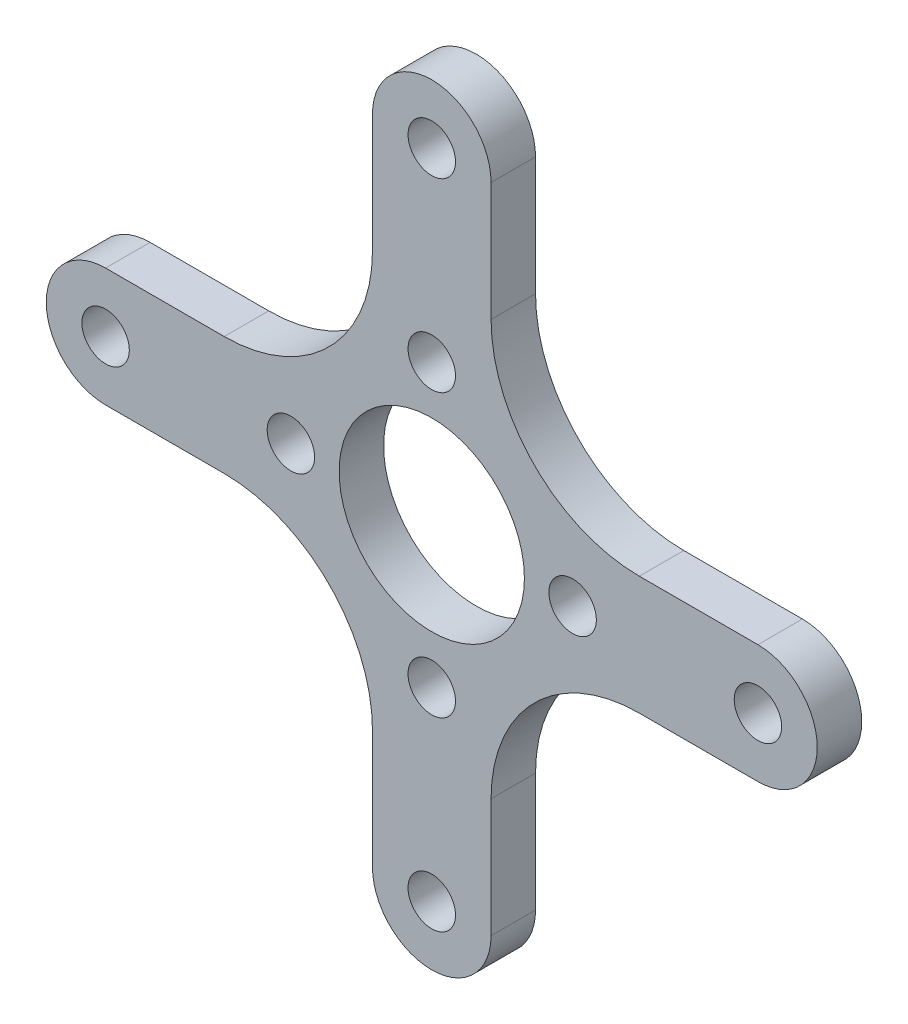
ISO-10303-21;
HEADER;
FILE_DESCRIPTION(('STEP AP214'),'2;1');
FILE_NAME('part.step','',(''),(''),'','','');
FILE_SCHEMA(('AUTOMOTIVE_DESIGN { 1 0 10303 214 1 1 1 1 }'));
ENDSEC;
DATA;
#1=APPLICATION_CONTEXT('core data for automotive mechanical design processes');
#2=APPLICATION_PROTOCOL_DEFINITION('international standard','automotive_design',2000,#1);
#3=PRODUCT_CONTEXT('',#1,'mechanical');
#4=PRODUCT('Part','Part','',(#3));
#5=PRODUCT_RELATED_PRODUCT_CATEGORY('part','',(#4));
#6=PRODUCT_DEFINITION_FORMATION('','',#4);
#7=PRODUCT_DEFINITION_CONTEXT('part definition',#1,'design');
#8=PRODUCT_DEFINITION('design','',#6,#7);
#9=PRODUCT_DEFINITION_SHAPE('','',#8);
#10=(LENGTH_UNIT() NAMED_UNIT(*) SI_UNIT(.MILLI.,.METRE.));
#11=(NAMED_UNIT(*) PLANE_ANGLE_UNIT() SI_UNIT($,.RADIAN.));
#12=(NAMED_UNIT(*) SI_UNIT($,.STERADIAN.) SOLID_ANGLE_UNIT());
#13=UNCERTAINTY_MEASURE_WITH_UNIT(LENGTH_MEASURE(1.E-05),#10,'distance_accuracy_value','');
#14=(GEOMETRIC_REPRESENTATION_CONTEXT(3) GLOBAL_UNCERTAINTY_ASSIGNED_CONTEXT((#13)) GLOBAL_UNIT_ASSIGNED_CONTEXT((#10,
#11,#12)) REPRESENTATION_CONTEXT('',''));
#15=CARTESIAN_POINT('',(0.,0.,0.));
#16=DIRECTION('',(0.,0.,1.));
#17=DIRECTION('',(1.,0.,0.));
#18=AXIS2_PLACEMENT_3D('',#15,#16,#17);
#19=CARTESIAN_POINT('',(-22.,0.,1.5));
#20=DIRECTION('',(0.,0.,-1.));
#21=DIRECTION('',(-1.,0.,0.));
#22=AXIS2_PLACEMENT_3D('',#19,#20,#21);
#23=PLANE('',#22);
#24=CARTESIAN_POINT('',(-22.,0.,1.5));
#25=DIRECTION('',(0.,0.,1.));
#26=DIRECTION('',(-1.,0.,0.));
#27=AXIS2_PLACEMENT_3D('',#24,#25,#26);
#28=CIRCLE('',#27,3.99999999999999);
#29=CARTESIAN_POINT('',(-22.,3.99999999999999,1.5));
#30=VERTEX_POINT('',#29);
#31=CARTESIAN_POINT('',(-22.,-4.,1.5));
#32=VERTEX_POINT('',#31);
#33=EDGE_CURVE('E236',#30,#32,#28,.T.);
#34=ORIENTED_EDGE('',*,*,#33,.T.);
#35=DIRECTION('',(1.,0.,0.));
#36=VECTOR('',#35,1.);
#37=CARTESIAN_POINT('',(-22.,-4.,1.5));
#38=LINE('',#37,#36);
#39=CARTESIAN_POINT('',(-14.,-3.99999999999999,1.5));
#40=VERTEX_POINT('',#39);
#41=EDGE_CURVE('E124',#32,#40,#38,.T.);
#42=ORIENTED_EDGE('',*,*,#41,.T.);
#43=CARTESIAN_POINT('',(-14.,-14.,1.5));
#44=DIRECTION('',(0.,0.,-1.));
#45=DIRECTION('',(-1.,0.,0.));
#46=AXIS2_PLACEMENT_3D('',#43,#44,#45);
#47=CIRCLE('',#46,10.);
#48=CARTESIAN_POINT('',(-3.99999999999999,-14.,1.5));
#49=VERTEX_POINT('',#48);
#50=EDGE_CURVE('E289',#40,#49,#47,.T.);
#51=ORIENTED_EDGE('',*,*,#50,.T.);
#52=DIRECTION('',(0.,-1.,0.));
#53=VECTOR('',#52,1.);
#54=CARTESIAN_POINT('',(-3.99999999999999,-14.,1.5));
#55=LINE('',#54,#53);
#56=CARTESIAN_POINT('',(-3.99999999999999,-22.,1.5));
#57=VERTEX_POINT('',#56);
#58=EDGE_CURVE('E309',#49,#57,#55,.T.);
#59=ORIENTED_EDGE('',*,*,#58,.T.);
#60=CARTESIAN_POINT('',(0.,-22.,1.5));
#61=DIRECTION('',(0.,0.,1.));
#62=DIRECTION('',(-1.,0.,0.));
#63=AXIS2_PLACEMENT_3D('',#60,#61,#62);
#64=CIRCLE('',#63,3.99999999999999);
#65=CARTESIAN_POINT('',(4.,-22.,1.5));
#66=VERTEX_POINT('',#65);
#67=EDGE_CURVE('E305',#57,#66,#64,.T.);
#68=ORIENTED_EDGE('',*,*,#67,.T.);
#69=DIRECTION('',(0.,1.,0.));
#70=VECTOR('',#69,1.);
#71=CARTESIAN_POINT('',(4.00000000000001,-14.,1.5));
#72=LINE('',#71,#70);
#73=CARTESIAN_POINT('',(4.00000000000001,-14.,1.5));
#74=VERTEX_POINT('',#73);
#75=EDGE_CURVE('E308',#66,#74,#72,.T.);
#76=ORIENTED_EDGE('',*,*,#75,.T.);
#77=CARTESIAN_POINT('',(14.,-14.,1.5));
#78=DIRECTION('',(0.,0.,-1.));
#79=DIRECTION('',(1.,0.,0.));
#80=AXIS2_PLACEMENT_3D('',#77,#78,#79);
#81=CIRCLE('',#80,10.);
#82=CARTESIAN_POINT('',(14.,-3.99999999999999,1.5));
#83=VERTEX_POINT('',#82);
#84=EDGE_CURVE('E313',#74,#83,#81,.T.);
#85=ORIENTED_EDGE('',*,*,#84,.T.);
#86=DIRECTION('',(1.,0.,0.));
#87=VECTOR('',#86,1.);
#88=CARTESIAN_POINT('',(22.,-3.99999999999999,1.5));
#89=LINE('',#88,#87);
#90=CARTESIAN_POINT('',(22.,-3.99999999999999,1.5));
#91=VERTEX_POINT('',#90);
#92=EDGE_CURVE('E320',#83,#91,#89,.T.);
#93=ORIENTED_EDGE('',*,*,#92,.T.);
#94=CARTESIAN_POINT('',(22.,0.,1.5));
#95=DIRECTION('',(0.,0.,1.));
#96=DIRECTION('',(1.,0.,0.));
#97=AXIS2_PLACEMENT_3D('',#94,#95,#96);
#98=CIRCLE('',#97,3.99999999999999);
#99=CARTESIAN_POINT('',(22.,3.99999999999999,1.5));
#100=VERTEX_POINT('',#99);
#101=EDGE_CURVE('E323',#91,#100,#98,.T.);
#102=ORIENTED_EDGE('',*,*,#101,.T.);
#103=DIRECTION('',(-1.,0.,0.));
#104=VECTOR('',#103,1.);
#105=CARTESIAN_POINT('',(22.,3.99999999999999,1.5));
#106=LINE('',#105,#104);
#107=CARTESIAN_POINT('',(14.,3.99999999999999,1.5));
#108=VERTEX_POINT('',#107);
#109=EDGE_CURVE('E326',#100,#108,#106,.T.);
#110=ORIENTED_EDGE('',*,*,#109,.T.);
#111=CARTESIAN_POINT('',(14.,14.,1.5));
#112=DIRECTION('',(0.,0.,-1.));
#113=DIRECTION('',(-1.,0.,0.));
#114=AXIS2_PLACEMENT_3D('',#111,#112,#113);
#115=CIRCLE('',#114,10.);
#116=CARTESIAN_POINT('',(4.00000000000001,14.,1.5));
#117=VERTEX_POINT('',#116);
#118=EDGE_CURVE('E329',#108,#117,#115,.T.);
#119=ORIENTED_EDGE('',*,*,#118,.T.);
#120=DIRECTION('',(0.,1.,0.));
#121=VECTOR('',#120,1.);
#122=CARTESIAN_POINT('',(4.00000000000001,14.,1.5));
#123=LINE('',#122,#121);
#124=CARTESIAN_POINT('',(4.,22.,1.5));
#125=VERTEX_POINT('',#124);
#126=EDGE_CURVE('E332',#117,#125,#123,.T.);
#127=ORIENTED_EDGE('',*,*,#126,.T.);
#128=CARTESIAN_POINT('',(0.,22.,1.5));
#129=DIRECTION('',(0.,0.,1.));
#130=DIRECTION('',(1.,0.,0.));
#131=AXIS2_PLACEMENT_3D('',#128,#129,#130);
#132=CIRCLE('',#131,4.);
#133=CARTESIAN_POINT('',(-4.,22.,1.5));
#134=VERTEX_POINT('',#133);
#135=EDGE_CURVE('E167',#125,#134,#132,.T.);
#136=ORIENTED_EDGE('',*,*,#135,.T.);
#137=DIRECTION('',(0.,-1.,0.));
#138=VECTOR('',#137,1.);
#139=CARTESIAN_POINT('',(-3.99999999999999,14.,1.5));
#140=LINE('',#139,#138);
#141=CARTESIAN_POINT('',(-4.,14.,1.5));
#142=VERTEX_POINT('',#141);
#143=EDGE_CURVE('E161',#134,#142,#140,.T.);
#144=ORIENTED_EDGE('',*,*,#143,.T.);
#145=CARTESIAN_POINT('',(-14.,14.,1.5));
#146=DIRECTION('',(0.,0.,-1.));
#147=DIRECTION('',(1.,0.,0.));
#148=AXIS2_PLACEMENT_3D('',#145,#146,#147);
#149=CIRCLE('',#148,10.);
#150=CARTESIAN_POINT('',(-14.,3.99999999999999,1.5));
#151=VERTEX_POINT('',#150);
#152=EDGE_CURVE('E165',#142,#151,#149,.T.);
#153=ORIENTED_EDGE('',*,*,#152,.T.);
#154=DIRECTION('',(-1.,0.,0.));
#155=VECTOR('',#154,1.);
#156=CARTESIAN_POINT('',(-22.,3.99999999999999,1.5));
#157=LINE('',#156,#155);
#158=EDGE_CURVE('E57',#151,#30,#157,.T.);
#159=ORIENTED_EDGE('',*,*,#158,.T.);
#160=EDGE_LOOP('',(#34,#42,#51,#59,#68,#76,#85,#93,#102,#110,#119,#127,#136,#144,#153,#159));
#161=FACE_BOUND('',#160,.T.);
#162=CARTESIAN_POINT('',(0.,0.,1.5));
#163=DIRECTION('',(0.,0.,1.));
#164=DIRECTION('',(1.,0.,0.));
#165=AXIS2_PLACEMENT_3D('',#162,#163,#164);
#166=CIRCLE('',#165,6.25);
#167=CARTESIAN_POINT('',(6.25,0.,1.5));
#168=VERTEX_POINT('',#167);
#169=EDGE_CURVE('E194',#168,#168,#166,.T.);
#170=ORIENTED_EDGE('',*,*,#169,.F.);
#171=EDGE_LOOP('',(#170));
#172=FACE_BOUND('',#171,.T.);
#173=CARTESIAN_POINT('',(-22.,0.,1.5));
#174=DIRECTION('',(0.,0.,1.));
#175=DIRECTION('',(1.,0.,0.));
#176=AXIS2_PLACEMENT_3D('',#173,#174,#175);
#177=CIRCLE('',#176,1.6);
#178=CARTESIAN_POINT('',(-20.4,0.,1.5));
#179=VERTEX_POINT('',#178);
#180=EDGE_CURVE('E462',#179,#179,#177,.T.);
#181=ORIENTED_EDGE('',*,*,#180,.F.);
#182=EDGE_LOOP('',(#181));
#183=FACE_BOUND('',#182,.T.);
#184=CARTESIAN_POINT('',(0.,9.5,1.5));
#185=DIRECTION('',(0.,0.,1.));
#186=DIRECTION('',(1.,0.,0.));
#187=AXIS2_PLACEMENT_3D('',#184,#185,#186);
#188=CIRCLE('',#187,1.6);
#189=CARTESIAN_POINT('',(1.60000000000001,9.5,1.5));
#190=VERTEX_POINT('',#189);
#191=EDGE_CURVE('E454',#190,#190,#188,.T.);
#192=ORIENTED_EDGE('',*,*,#191,.F.);
#193=EDGE_LOOP('',(#192));
#194=FACE_BOUND('',#193,.T.);
#195=CARTESIAN_POINT('',(-9.5,0.,1.5));
#196=DIRECTION('',(0.,0.,1.));
#197=DIRECTION('',(1.,0.,0.));
#198=AXIS2_PLACEMENT_3D('',#195,#196,#197);
#199=CIRCLE('',#198,1.6);
#200=CARTESIAN_POINT('',(-7.9,0.,1.5));
#201=VERTEX_POINT('',#200);
#202=EDGE_CURVE('E446',#201,#201,#199,.T.);
#203=ORIENTED_EDGE('',*,*,#202,.F.);
#204=EDGE_LOOP('',(#203));
#205=FACE_BOUND('',#204,.T.);
#206=CARTESIAN_POINT('',(0.,22.,1.5));
#207=DIRECTION('',(0.,0.,1.));
#208=DIRECTION('',(1.,0.,0.));
#209=AXIS2_PLACEMENT_3D('',#206,#207,#208);
#210=CIRCLE('',#209,1.6);
#211=CARTESIAN_POINT('',(1.60000000000001,22.,1.5));
#212=VERTEX_POINT('',#211);
#213=EDGE_CURVE('E438',#212,#212,#210,.T.);
#214=ORIENTED_EDGE('',*,*,#213,.F.);
#215=EDGE_LOOP('',(#214));
#216=FACE_BOUND('',#215,.T.);
#217=CARTESIAN_POINT('',(22.,0.,1.5));
#218=DIRECTION('',(0.,0.,1.));
#219=DIRECTION('',(-1.,0.,0.));
#220=AXIS2_PLACEMENT_3D('',#217,#218,#219);
#221=CIRCLE('',#220,1.6);
#222=CARTESIAN_POINT('',(20.4,0.,1.5));
#223=VERTEX_POINT('',#222);
#224=EDGE_CURVE('E430',#223,#223,#221,.T.);
#225=ORIENTED_EDGE('',*,*,#224,.F.);
#226=EDGE_LOOP('',(#225));
#227=FACE_BOUND('',#226,.T.);
#228=CARTESIAN_POINT('',(9.5,0.,1.5));
#229=DIRECTION('',(0.,0.,1.));
#230=DIRECTION('',(-1.,0.,0.));
#231=AXIS2_PLACEMENT_3D('',#228,#229,#230);
#232=CIRCLE('',#231,1.6);
#233=CARTESIAN_POINT('',(7.9,0.,1.5));
#234=VERTEX_POINT('',#233);
#235=EDGE_CURVE('E422',#234,#234,#232,.T.);
#236=ORIENTED_EDGE('',*,*,#235,.F.);
#237=EDGE_LOOP('',(#236));
#238=FACE_BOUND('',#237,.T.);
#239=CARTESIAN_POINT('',(0.,-22.,1.5));
#240=DIRECTION('',(0.,0.,1.));
#241=DIRECTION('',(-1.,0.,0.));
#242=AXIS2_PLACEMENT_3D('',#239,#240,#241);
#243=CIRCLE('',#242,1.6);
#244=CARTESIAN_POINT('',(-1.6,-22.,1.5));
#245=VERTEX_POINT('',#244);
#246=EDGE_CURVE('E414',#245,#245,#243,.T.);
#247=ORIENTED_EDGE('',*,*,#246,.F.);
#248=EDGE_LOOP('',(#247));
#249=FACE_BOUND('',#248,.T.);
#250=CARTESIAN_POINT('',(0.,-9.5,1.5));
#251=DIRECTION('',(0.,0.,1.));
#252=DIRECTION('',(-1.,0.,0.));
#253=AXIS2_PLACEMENT_3D('',#250,#251,#252);
#254=CIRCLE('',#253,1.6);
#255=CARTESIAN_POINT('',(-1.59999999999999,-9.5,1.5));
#256=VERTEX_POINT('',#255);
#257=EDGE_CURVE('E403',#256,#256,#254,.T.);
#258=ORIENTED_EDGE('',*,*,#257,.F.);
#259=EDGE_LOOP('',(#258));
#260=FACE_BOUND('',#259,.T.);
#261=ADVANCED_FACE('F39',(#161,#172,#183,#194,#205,#216,#227,#238,#249,#260),#23,.F.);
#262=CARTESIAN_POINT('',(-22.,0.,-1.5));
#263=DIRECTION('',(0.,0.,-1.));
#264=DIRECTION('',(-1.,0.,0.));
#265=AXIS2_PLACEMENT_3D('',#262,#263,#264);
#266=PLANE('',#265);
#267=CARTESIAN_POINT('',(0.,-22.,-1.5));
#268=DIRECTION('',(0.,0.,1.));
#269=DIRECTION('',(-1.,0.,0.));
#270=AXIS2_PLACEMENT_3D('',#267,#268,#269);
#271=CIRCLE('',#270,1.6);
#272=CARTESIAN_POINT('',(-1.6,-22.,-1.5));
#273=VERTEX_POINT('',#272);
#274=EDGE_CURVE('E411',#273,#273,#271,.T.);
#275=ORIENTED_EDGE('',*,*,#274,.T.);
#276=EDGE_LOOP('',(#275));
#277=FACE_BOUND('',#276,.T.);
#278=CARTESIAN_POINT('',(22.,0.,-1.5));
#279=DIRECTION('',(0.,0.,1.));
#280=DIRECTION('',(-1.,0.,0.));
#281=AXIS2_PLACEMENT_3D('',#278,#279,#280);
#282=CIRCLE('',#281,1.6);
#283=CARTESIAN_POINT('',(20.4,0.,-1.5));
#284=VERTEX_POINT('',#283);
#285=EDGE_CURVE('E426',#284,#284,#282,.T.);
#286=ORIENTED_EDGE('',*,*,#285,.T.);
#287=EDGE_LOOP('',(#286));
#288=FACE_BOUND('',#287,.T.);
#289=CARTESIAN_POINT('',(-9.5,0.,-1.5));
#290=DIRECTION('',(0.,0.,1.));
#291=DIRECTION('',(1.,0.,0.));
#292=AXIS2_PLACEMENT_3D('',#289,#290,#291);
#293=CIRCLE('',#292,1.6);
#294=CARTESIAN_POINT('',(-7.9,0.,-1.5));
#295=VERTEX_POINT('',#294);
#296=EDGE_CURVE('E442',#295,#295,#293,.T.);
#297=ORIENTED_EDGE('',*,*,#296,.T.);
#298=EDGE_LOOP('',(#297));
#299=FACE_BOUND('',#298,.T.);
#300=CARTESIAN_POINT('',(-22.,0.,-1.5));
#301=DIRECTION('',(0.,0.,1.));
#302=DIRECTION('',(1.,0.,0.));
#303=AXIS2_PLACEMENT_3D('',#300,#301,#302);
#304=CIRCLE('',#303,1.6);
#305=CARTESIAN_POINT('',(-20.4,0.,-1.5));
#306=VERTEX_POINT('',#305);
#307=EDGE_CURVE('E458',#306,#306,#304,.T.);
#308=ORIENTED_EDGE('',*,*,#307,.T.);
#309=EDGE_LOOP('',(#308));
#310=FACE_BOUND('',#309,.T.);
#311=CARTESIAN_POINT('',(-22.,0.,-1.5));
#312=DIRECTION('',(0.,0.,1.));
#313=DIRECTION('',(-1.,0.,0.));
#314=AXIS2_PLACEMENT_3D('',#311,#312,#313);
#315=CIRCLE('',#314,3.99999999999999);
#316=CARTESIAN_POINT('',(-22.,3.99999999999999,-1.5));
#317=VERTEX_POINT('',#316);
#318=CARTESIAN_POINT('',(-22.,-4.,-1.5));
#319=VERTEX_POINT('',#318);
#320=EDGE_CURVE('E189',#317,#319,#315,.T.);
#321=ORIENTED_EDGE('',*,*,#320,.F.);
#322=DIRECTION('',(-1.,0.,0.));
#323=VECTOR('',#322,1.);
#324=CARTESIAN_POINT('',(-22.,3.99999999999999,-1.5));
#325=LINE('',#324,#323);
#326=CARTESIAN_POINT('',(-14.,3.99999999999999,-1.5));
#327=VERTEX_POINT('',#326);
#328=EDGE_CURVE('E116',#327,#317,#325,.T.);
#329=ORIENTED_EDGE('',*,*,#328,.F.);
#330=CARTESIAN_POINT('',(-14.,14.,-1.5));
#331=DIRECTION('',(0.,0.,-1.));
#332=DIRECTION('',(1.,0.,0.));
#333=AXIS2_PLACEMENT_3D('',#330,#331,#332);
#334=CIRCLE('',#333,10.);
#335=CARTESIAN_POINT('',(-4.,14.,-1.5));
#336=VERTEX_POINT('',#335);
#337=EDGE_CURVE('E110',#336,#327,#334,.T.);
#338=ORIENTED_EDGE('',*,*,#337,.F.);
#339=DIRECTION('',(0.,-1.,0.));
#340=VECTOR('',#339,1.);
#341=CARTESIAN_POINT('',(-3.99999999999999,14.,-1.5));
#342=LINE('',#341,#340);
#343=CARTESIAN_POINT('',(-4.,22.,-1.5));
#344=VERTEX_POINT('',#343);
#345=EDGE_CURVE('E176',#344,#336,#342,.T.);
#346=ORIENTED_EDGE('',*,*,#345,.F.);
#347=CARTESIAN_POINT('',(0.,22.,-1.5));
#348=DIRECTION('',(0.,0.,1.));
#349=DIRECTION('',(1.,0.,0.));
#350=AXIS2_PLACEMENT_3D('',#347,#348,#349);
#351=CIRCLE('',#350,4.);
#352=CARTESIAN_POINT('',(4.,22.,-1.5));
#353=VERTEX_POINT('',#352);
#354=EDGE_CURVE('E227',#353,#344,#351,.T.);
#355=ORIENTED_EDGE('',*,*,#354,.F.);
#356=DIRECTION('',(0.,1.,0.));
#357=VECTOR('',#356,1.);
#358=CARTESIAN_POINT('',(4.00000000000001,14.,-1.5));
#359=LINE('',#358,#357);
#360=CARTESIAN_POINT('',(4.00000000000001,14.,-1.5));
#361=VERTEX_POINT('',#360);
#362=EDGE_CURVE('E224',#361,#353,#359,.T.);
#363=ORIENTED_EDGE('',*,*,#362,.F.);
#364=CARTESIAN_POINT('',(14.,14.,-1.5));
#365=DIRECTION('',(0.,0.,-1.));
#366=DIRECTION('',(-1.,0.,0.));
#367=AXIS2_PLACEMENT_3D('',#364,#365,#366);
#368=CIRCLE('',#367,10.);
#369=CARTESIAN_POINT('',(14.,3.99999999999999,-1.5));
#370=VERTEX_POINT('',#369);
#371=EDGE_CURVE('E221',#370,#361,#368,.T.);
#372=ORIENTED_EDGE('',*,*,#371,.F.);
#373=DIRECTION('',(-1.,0.,0.));
#374=VECTOR('',#373,1.);
#375=CARTESIAN_POINT('',(22.,3.99999999999999,-1.5));
#376=LINE('',#375,#374);
#377=CARTESIAN_POINT('',(22.,3.99999999999999,-1.5));
#378=VERTEX_POINT('',#377);
#379=EDGE_CURVE('E218',#378,#370,#376,.T.);
#380=ORIENTED_EDGE('',*,*,#379,.F.);
#381=CARTESIAN_POINT('',(22.,0.,-1.5));
#382=DIRECTION('',(0.,0.,1.));
#383=DIRECTION('',(1.,0.,0.));
#384=AXIS2_PLACEMENT_3D('',#381,#382,#383);
#385=CIRCLE('',#384,3.99999999999999);
#386=CARTESIAN_POINT('',(22.,-3.99999999999999,-1.5));
#387=VERTEX_POINT('',#386);
#388=EDGE_CURVE('E215',#387,#378,#385,.T.);
#389=ORIENTED_EDGE('',*,*,#388,.F.);
#390=DIRECTION('',(1.,0.,0.));
#391=VECTOR('',#390,1.);
#392=CARTESIAN_POINT('',(22.,-3.99999999999999,-1.5));
#393=LINE('',#392,#391);
#394=CARTESIAN_POINT('',(14.,-3.99999999999999,-1.5));
#395=VERTEX_POINT('',#394);
#396=EDGE_CURVE('E212',#395,#387,#393,.T.);
#397=ORIENTED_EDGE('',*,*,#396,.F.);
#398=CARTESIAN_POINT('',(14.,-14.,-1.5));
#399=DIRECTION('',(0.,0.,-1.));
#400=DIRECTION('',(1.,0.,0.));
#401=AXIS2_PLACEMENT_3D('',#398,#399,#400);
#402=CIRCLE('',#401,10.);
#403=CARTESIAN_POINT('',(4.00000000000001,-14.,-1.5));
#404=VERTEX_POINT('',#403);
#405=EDGE_CURVE('E209',#404,#395,#402,.T.);
#406=ORIENTED_EDGE('',*,*,#405,.F.);
#407=DIRECTION('',(0.,1.,0.));
#408=VECTOR('',#407,1.);
#409=CARTESIAN_POINT('',(4.00000000000001,-14.,-1.5));
#410=LINE('',#409,#408);
#411=CARTESIAN_POINT('',(4.,-22.,-1.5));
#412=VERTEX_POINT('',#411);
#413=EDGE_CURVE('E206',#412,#404,#410,.T.);
#414=ORIENTED_EDGE('',*,*,#413,.F.);
#415=CARTESIAN_POINT('',(0.,-22.,-1.5));
#416=DIRECTION('',(0.,0.,1.));
#417=DIRECTION('',(-1.,0.,0.));
#418=AXIS2_PLACEMENT_3D('',#415,#416,#417);
#419=CIRCLE('',#418,3.99999999999999);
#420=CARTESIAN_POINT('',(-3.99999999999999,-22.,-1.5));
#421=VERTEX_POINT('',#420);
#422=EDGE_CURVE('E203',#421,#412,#419,.T.);
#423=ORIENTED_EDGE('',*,*,#422,.F.);
#424=DIRECTION('',(0.,-1.,0.));
#425=VECTOR('',#424,1.);
#426=CARTESIAN_POINT('',(-3.99999999999999,-14.,-1.5));
#427=LINE('',#426,#425);
#428=CARTESIAN_POINT('',(-3.99999999999999,-14.,-1.5));
#429=VERTEX_POINT('',#428);
#430=EDGE_CURVE('E200',#429,#421,#427,.T.);
#431=ORIENTED_EDGE('',*,*,#430,.F.);
#432=CARTESIAN_POINT('',(-14.,-14.,-1.5));
#433=DIRECTION('',(0.,0.,-1.));
#434=DIRECTION('',(-1.,0.,0.));
#435=AXIS2_PLACEMENT_3D('',#432,#433,#434);
#436=CIRCLE('',#435,10.);
#437=CARTESIAN_POINT('',(-14.,-3.99999999999999,-1.5));
#438=VERTEX_POINT('',#437);
#439=EDGE_CURVE('E197',#438,#429,#436,.T.);
#440=ORIENTED_EDGE('',*,*,#439,.F.);
#441=DIRECTION('',(1.,0.,0.));
#442=VECTOR('',#441,1.);
#443=CARTESIAN_POINT('',(-22.,-4.,-1.5));
#444=LINE('',#443,#442);
#445=EDGE_CURVE('E193',#319,#438,#444,.T.);
#446=ORIENTED_EDGE('',*,*,#445,.F.);
#447=EDGE_LOOP('',(#321,#329,#338,#346,#355,#363,#372,#380,#389,#397,#406,#414,#423,#431,#440,#446));
#448=FACE_BOUND('',#447,.T.);
#449=CARTESIAN_POINT('',(0.,0.,-1.5));
#450=DIRECTION('',(0.,0.,1.));
#451=DIRECTION('',(1.,0.,0.));
#452=AXIS2_PLACEMENT_3D('',#449,#450,#451);
#453=CIRCLE('',#452,6.25);
#454=CARTESIAN_POINT('',(6.25,0.,-1.5));
#455=VERTEX_POINT('',#454);
#456=EDGE_CURVE('E466',#455,#455,#453,.T.);
#457=ORIENTED_EDGE('',*,*,#456,.T.);
#458=EDGE_LOOP('',(#457));
#459=FACE_BOUND('',#458,.T.);
#460=CARTESIAN_POINT('',(0.,9.5,-1.5));
#461=DIRECTION('',(0.,0.,1.));
#462=DIRECTION('',(1.,0.,0.));
#463=AXIS2_PLACEMENT_3D('',#460,#461,#462);
#464=CIRCLE('',#463,1.6);
#465=CARTESIAN_POINT('',(1.60000000000001,9.5,-1.5));
#466=VERTEX_POINT('',#465);
#467=EDGE_CURVE('E450',#466,#466,#464,.T.);
#468=ORIENTED_EDGE('',*,*,#467,.T.);
#469=EDGE_LOOP('',(#468));
#470=FACE_BOUND('',#469,.T.);
#471=CARTESIAN_POINT('',(0.,22.,-1.5));
#472=DIRECTION('',(0.,0.,1.));
#473=DIRECTION('',(1.,0.,0.));
#474=AXIS2_PLACEMENT_3D('',#471,#472,#473);
#475=CIRCLE('',#474,1.6);
#476=CARTESIAN_POINT('',(1.60000000000001,22.,-1.5));
#477=VERTEX_POINT('',#476);
#478=EDGE_CURVE('E434',#477,#477,#475,.T.);
#479=ORIENTED_EDGE('',*,*,#478,.T.);
#480=EDGE_LOOP('',(#479));
#481=FACE_BOUND('',#480,.T.);
#482=CARTESIAN_POINT('',(9.5,0.,-1.5));
#483=DIRECTION('',(0.,0.,1.));
#484=DIRECTION('',(-1.,0.,0.));
#485=AXIS2_PLACEMENT_3D('',#482,#483,#484);
#486=CIRCLE('',#485,1.6);
#487=CARTESIAN_POINT('',(7.9,0.,-1.5));
#488=VERTEX_POINT('',#487);
#489=EDGE_CURVE('E418',#488,#488,#486,.T.);
#490=ORIENTED_EDGE('',*,*,#489,.T.);
#491=EDGE_LOOP('',(#490));
#492=FACE_BOUND('',#491,.T.);
#493=CARTESIAN_POINT('',(0.,-9.5,-1.5));
#494=DIRECTION('',(0.,0.,1.));
#495=DIRECTION('',(-1.,0.,0.));
#496=AXIS2_PLACEMENT_3D('',#493,#494,#495);
#497=CIRCLE('',#496,1.6);
#498=CARTESIAN_POINT('',(-1.59999999999999,-9.5,-1.5));
#499=VERTEX_POINT('',#498);
#500=EDGE_CURVE('E406',#499,#499,#497,.T.);
#501=ORIENTED_EDGE('',*,*,#500,.T.);
#502=EDGE_LOOP('',(#501));
#503=FACE_BOUND('',#502,.T.);
#504=ADVANCED_FACE('F293',(#277,#288,#299,#310,#448,#459,#470,#481,#492,#503),#266,.T.);
#505=CARTESIAN_POINT('',(-22.,0.,1.5));
#506=DIRECTION('',(0.,0.,-1.));
#507=DIRECTION('',(-1.,0.,0.));
#508=AXIS2_PLACEMENT_3D('',#505,#506,#507);
#509=CYLINDRICAL_SURFACE('',#508,3.99999999999999);
#510=ORIENTED_EDGE('',*,*,#320,.T.);
#511=DIRECTION('',(0.,0.,-1.));
#512=VECTOR('',#511,1.);
#513=CARTESIAN_POINT('',(-22.,-4.,1.5));
#514=LINE('',#513,#512);
#515=EDGE_CURVE('E11',#32,#319,#514,.T.);
#516=ORIENTED_EDGE('',*,*,#515,.F.);
#517=ORIENTED_EDGE('',*,*,#33,.F.);
#518=DIRECTION('',(0.,0.,-1.));
#519=VECTOR('',#518,1.);
#520=CARTESIAN_POINT('',(-22.,3.99999999999999,1.5));
#521=LINE('',#520,#519);
#522=EDGE_CURVE('E185',#30,#317,#521,.T.);
#523=ORIENTED_EDGE('',*,*,#522,.T.);
#524=EDGE_LOOP('',(#510,#516,#517,#523));
#525=FACE_BOUND('',#524,.T.);
#526=ADVANCED_FACE('F41',(#525),#509,.T.);
#527=CARTESIAN_POINT('',(-22.,-4.,1.5));
#528=DIRECTION('',(0.,1.,0.));
#529=DIRECTION('',(-1.,0.,0.));
#530=AXIS2_PLACEMENT_3D('',#527,#528,#529);
#531=PLANE('',#530);
#532=ORIENTED_EDGE('',*,*,#445,.T.);
#533=DIRECTION('',(0.,0.,-1.));
#534=VECTOR('',#533,1.);
#535=CARTESIAN_POINT('',(-14.,-3.99999999999999,1.5));
#536=LINE('',#535,#534);
#537=EDGE_CURVE('E49',#40,#438,#536,.T.);
#538=ORIENTED_EDGE('',*,*,#537,.F.);
#539=ORIENTED_EDGE('',*,*,#41,.F.);
#540=ORIENTED_EDGE('',*,*,#515,.T.);
#541=EDGE_LOOP('',(#532,#538,#539,#540));
#542=FACE_BOUND('',#541,.T.);
#543=ADVANCED_FACE('F669',(#542),#531,.F.);
#544=CARTESIAN_POINT('',(-14.,-14.,1.5));
#545=DIRECTION('',(0.,0.,-1.));
#546=DIRECTION('',(-1.,0.,0.));
#547=AXIS2_PLACEMENT_3D('',#544,#545,#546);
#548=CYLINDRICAL_SURFACE('',#547,10.);
#549=ORIENTED_EDGE('',*,*,#439,.T.);
#550=DIRECTION('',(0.,0.,-1.));
#551=VECTOR('',#550,1.);
#552=CARTESIAN_POINT('',(-3.99999999999999,-14.,1.5));
#553=LINE('',#552,#551);
#554=EDGE_CURVE('E279',#49,#429,#553,.T.);
#555=ORIENTED_EDGE('',*,*,#554,.F.);
#556=ORIENTED_EDGE('',*,*,#50,.F.);
#557=ORIENTED_EDGE('',*,*,#537,.T.);
#558=EDGE_LOOP('',(#549,#555,#556,#557));
#559=FACE_BOUND('',#558,.T.);
#560=ADVANCED_FACE('F287',(#559),#548,.F.);
#561=CARTESIAN_POINT('',(-3.99999999999999,-14.,1.5));
#562=DIRECTION('',(1.,0.,0.));
#563=DIRECTION('',(0.,1.,0.));
#564=AXIS2_PLACEMENT_3D('',#561,#562,#563);
#565=PLANE('',#564);
#566=ORIENTED_EDGE('',*,*,#430,.T.);
#567=DIRECTION('',(0.,0.,-1.));
#568=VECTOR('',#567,1.);
#569=CARTESIAN_POINT('',(-3.99999999999999,-22.,1.5));
#570=LINE('',#569,#568);
#571=EDGE_CURVE('E275',#57,#421,#570,.T.);
#572=ORIENTED_EDGE('',*,*,#571,.F.);
#573=ORIENTED_EDGE('',*,*,#58,.F.);
#574=ORIENTED_EDGE('',*,*,#554,.T.);
#575=EDGE_LOOP('',(#566,#572,#573,#574));
#576=FACE_BOUND('',#575,.T.);
#577=ADVANCED_FACE('F299',(#576),#565,.F.);
#578=CARTESIAN_POINT('',(0.,-22.,1.5));
#579=DIRECTION('',(0.,0.,-1.));
#580=DIRECTION('',(-1.,0.,0.));
#581=AXIS2_PLACEMENT_3D('',#578,#579,#580);
#582=CYLINDRICAL_SURFACE('',#581,3.99999999999999);
#583=ORIENTED_EDGE('',*,*,#422,.T.);
#584=DIRECTION('',(0.,0.,-1.));
#585=VECTOR('',#584,1.);
#586=CARTESIAN_POINT('',(4.,-22.,1.5));
#587=LINE('',#586,#585);
#588=EDGE_CURVE('E271',#66,#412,#587,.T.);
#589=ORIENTED_EDGE('',*,*,#588,.F.);
#590=ORIENTED_EDGE('',*,*,#67,.F.);
#591=ORIENTED_EDGE('',*,*,#571,.T.);
#592=EDGE_LOOP('',(#583,#589,#590,#591));
#593=FACE_BOUND('',#592,.T.);
#594=ADVANCED_FACE('F303',(#593),#582,.T.);
#595=CARTESIAN_POINT('',(4.00000000000001,-14.,1.5));
#596=DIRECTION('',(-1.,0.,0.));
#597=DIRECTION('',(0.,-1.,0.));
#598=AXIS2_PLACEMENT_3D('',#595,#596,#597);
#599=PLANE('',#598);
#600=ORIENTED_EDGE('',*,*,#413,.T.);
#601=DIRECTION('',(0.,0.,-1.));
#602=VECTOR('',#601,1.);
#603=CARTESIAN_POINT('',(4.00000000000001,-14.,1.5));
#604=LINE('',#603,#602);
#605=EDGE_CURVE('E267',#74,#404,#604,.T.);
#606=ORIENTED_EDGE('',*,*,#605,.F.);
#607=ORIENTED_EDGE('',*,*,#75,.F.);
#608=ORIENTED_EDGE('',*,*,#588,.T.);
#609=EDGE_LOOP('',(#600,#606,#607,#608));
#610=FACE_BOUND('',#609,.T.);
#611=ADVANCED_FACE('F634',(#610),#599,.F.);
#612=CARTESIAN_POINT('',(14.,-14.,1.5));
#613=DIRECTION('',(0.,0.,-1.));
#614=DIRECTION('',(-1.,0.,0.));
#615=AXIS2_PLACEMENT_3D('',#612,#613,#614);
#616=CYLINDRICAL_SURFACE('',#615,10.);
#617=ORIENTED_EDGE('',*,*,#405,.T.);
#618=DIRECTION('',(0.,0.,-1.));
#619=VECTOR('',#618,1.);
#620=CARTESIAN_POINT('',(14.,-3.99999999999999,1.5));
#621=LINE('',#620,#619);
#622=EDGE_CURVE('E263',#83,#395,#621,.T.);
#623=ORIENTED_EDGE('',*,*,#622,.F.);
#624=ORIENTED_EDGE('',*,*,#84,.F.);
#625=ORIENTED_EDGE('',*,*,#605,.T.);
#626=EDGE_LOOP('',(#617,#623,#624,#625));
#627=FACE_BOUND('',#626,.T.);
#628=ADVANCED_FACE('F624',(#627),#616,.F.);
#629=CARTESIAN_POINT('',(22.,-3.99999999999999,1.5));
#630=DIRECTION('',(0.,1.,0.));
#631=DIRECTION('',(-1.,0.,0.));
#632=AXIS2_PLACEMENT_3D('',#629,#630,#631);
#633=PLANE('',#632);
#634=ORIENTED_EDGE('',*,*,#396,.T.);
#635=DIRECTION('',(0.,0.,-1.));
#636=VECTOR('',#635,1.);
#637=CARTESIAN_POINT('',(22.,-3.99999999999999,1.5));
#638=LINE('',#637,#636);
#639=EDGE_CURVE('E259',#91,#387,#638,.T.);
#640=ORIENTED_EDGE('',*,*,#639,.F.);
#641=ORIENTED_EDGE('',*,*,#92,.F.);
#642=ORIENTED_EDGE('',*,*,#622,.T.);
#643=EDGE_LOOP('',(#634,#640,#641,#642));
#644=FACE_BOUND('',#643,.T.);
#645=ADVANCED_FACE('F614',(#644),#633,.F.);
#646=CARTESIAN_POINT('',(22.,0.,1.5));
#647=DIRECTION('',(0.,0.,-1.));
#648=DIRECTION('',(-1.,0.,0.));
#649=AXIS2_PLACEMENT_3D('',#646,#647,#648);
#650=CYLINDRICAL_SURFACE('',#649,3.99999999999999);
#651=ORIENTED_EDGE('',*,*,#388,.T.);
#652=DIRECTION('',(0.,0.,-1.));
#653=VECTOR('',#652,1.);
#654=CARTESIAN_POINT('',(22.,3.99999999999999,1.5));
#655=LINE('',#654,#653);
#656=EDGE_CURVE('E255',#100,#378,#655,.T.);
#657=ORIENTED_EDGE('',*,*,#656,.F.);
#658=ORIENTED_EDGE('',*,*,#101,.F.);
#659=ORIENTED_EDGE('',*,*,#639,.T.);
#660=EDGE_LOOP('',(#651,#657,#658,#659));
#661=FACE_BOUND('',#660,.T.);
#662=ADVANCED_FACE('F604',(#661),#650,.T.);
#663=CARTESIAN_POINT('',(22.,3.99999999999999,1.5));
#664=DIRECTION('',(0.,-1.,0.));
#665=DIRECTION('',(1.,0.,0.));
#666=AXIS2_PLACEMENT_3D('',#663,#664,#665);
#667=PLANE('',#666);
#668=ORIENTED_EDGE('',*,*,#379,.T.);
#669=DIRECTION('',(0.,0.,-1.));
#670=VECTOR('',#669,1.);
#671=CARTESIAN_POINT('',(14.,3.99999999999999,1.5));
#672=LINE('',#671,#670);
#673=EDGE_CURVE('E251',#108,#370,#672,.T.);
#674=ORIENTED_EDGE('',*,*,#673,.F.);
#675=ORIENTED_EDGE('',*,*,#109,.F.);
#676=ORIENTED_EDGE('',*,*,#656,.T.);
#677=EDGE_LOOP('',(#668,#674,#675,#676));
#678=FACE_BOUND('',#677,.T.);
#679=ADVANCED_FACE('F594',(#678),#667,.F.);
#680=CARTESIAN_POINT('',(14.,14.,1.5));
#681=DIRECTION('',(0.,0.,-1.));
#682=DIRECTION('',(-1.,0.,0.));
#683=AXIS2_PLACEMENT_3D('',#680,#681,#682);
#684=CYLINDRICAL_SURFACE('',#683,10.);
#685=ORIENTED_EDGE('',*,*,#371,.T.);
#686=DIRECTION('',(0.,0.,-1.));
#687=VECTOR('',#686,1.);
#688=CARTESIAN_POINT('',(4.00000000000001,14.,1.5));
#689=LINE('',#688,#687);
#690=EDGE_CURVE('E247',#117,#361,#689,.T.);
#691=ORIENTED_EDGE('',*,*,#690,.F.);
#692=ORIENTED_EDGE('',*,*,#118,.F.);
#693=ORIENTED_EDGE('',*,*,#673,.T.);
#694=EDGE_LOOP('',(#685,#691,#692,#693));
#695=FACE_BOUND('',#694,.T.);
#696=ADVANCED_FACE('F585',(#695),#684,.F.);
#697=CARTESIAN_POINT('',(4.00000000000001,14.,1.5));
#698=DIRECTION('',(-1.,0.,0.));
#699=DIRECTION('',(0.,-1.,0.));
#700=AXIS2_PLACEMENT_3D('',#697,#698,#699);
#701=PLANE('',#700);
#702=ORIENTED_EDGE('',*,*,#362,.T.);
#703=DIRECTION('',(0.,0.,-1.));
#704=VECTOR('',#703,1.);
#705=CARTESIAN_POINT('',(4.,22.,1.5));
#706=LINE('',#705,#704);
#707=EDGE_CURVE('E243',#125,#353,#706,.T.);
#708=ORIENTED_EDGE('',*,*,#707,.F.);
#709=ORIENTED_EDGE('',*,*,#126,.F.);
#710=ORIENTED_EDGE('',*,*,#690,.T.);
#711=EDGE_LOOP('',(#702,#708,#709,#710));
#712=FACE_BOUND('',#711,.T.);
#713=ADVANCED_FACE('F340',(#712),#701,.F.);
#714=CARTESIAN_POINT('',(0.,22.,1.5));
#715=DIRECTION('',(0.,0.,-1.));
#716=DIRECTION('',(-1.,0.,0.));
#717=AXIS2_PLACEMENT_3D('',#714,#715,#716);
#718=CYLINDRICAL_SURFACE('',#717,4.);
#719=ORIENTED_EDGE('',*,*,#354,.T.);
#720=DIRECTION('',(0.,0.,-1.));
#721=VECTOR('',#720,1.);
#722=CARTESIAN_POINT('',(-4.,22.,1.5));
#723=LINE('',#722,#721);
#724=EDGE_CURVE('E178',#134,#344,#723,.T.);
#725=ORIENTED_EDGE('',*,*,#724,.F.);
#726=ORIENTED_EDGE('',*,*,#135,.F.);
#727=ORIENTED_EDGE('',*,*,#707,.T.);
#728=EDGE_LOOP('',(#719,#725,#726,#727));
#729=FACE_BOUND('',#728,.T.);
#730=ADVANCED_FACE('F344',(#729),#718,.T.);
#731=CARTESIAN_POINT('',(-3.99999999999999,14.,1.5));
#732=DIRECTION('',(1.,0.,0.));
#733=DIRECTION('',(0.,1.,0.));
#734=AXIS2_PLACEMENT_3D('',#731,#732,#733);
#735=PLANE('',#734);
#736=ORIENTED_EDGE('',*,*,#345,.T.);
#737=DIRECTION('',(0.,0.,-1.));
#738=VECTOR('',#737,1.);
#739=CARTESIAN_POINT('',(-4.,14.,1.5));
#740=LINE('',#739,#738);
#741=EDGE_CURVE('E173',#142,#336,#740,.T.);
#742=ORIENTED_EDGE('',*,*,#741,.F.);
#743=ORIENTED_EDGE('',*,*,#143,.F.);
#744=ORIENTED_EDGE('',*,*,#724,.T.);
#745=EDGE_LOOP('',(#736,#742,#743,#744));
#746=FACE_BOUND('',#745,.T.);
#747=ADVANCED_FACE('F174',(#746),#735,.F.);
#748=CARTESIAN_POINT('',(-14.,14.,1.5));
#749=DIRECTION('',(0.,0.,-1.));
#750=DIRECTION('',(-1.,0.,0.));
#751=AXIS2_PLACEMENT_3D('',#748,#749,#750);
#752=CYLINDRICAL_SURFACE('',#751,10.);
#753=ORIENTED_EDGE('',*,*,#337,.T.);
#754=DIRECTION('',(0.,0.,-1.));
#755=VECTOR('',#754,1.);
#756=CARTESIAN_POINT('',(-14.,3.99999999999999,1.5));
#757=LINE('',#756,#755);
#758=EDGE_CURVE('E179',#151,#327,#757,.T.);
#759=ORIENTED_EDGE('',*,*,#758,.F.);
#760=ORIENTED_EDGE('',*,*,#152,.F.);
#761=ORIENTED_EDGE('',*,*,#741,.T.);
#762=EDGE_LOOP('',(#753,#759,#760,#761));
#763=FACE_BOUND('',#762,.T.);
#764=ADVANCED_FACE('F181',(#763),#752,.F.);
#765=CARTESIAN_POINT('',(-22.,3.99999999999999,1.5));
#766=DIRECTION('',(0.,-1.,0.));
#767=DIRECTION('',(0.,0.,-1.));
#768=AXIS2_PLACEMENT_3D('',#765,#766,#767);
#769=PLANE('',#768);
#770=ORIENTED_EDGE('',*,*,#328,.T.);
#771=ORIENTED_EDGE('',*,*,#522,.F.);
#772=ORIENTED_EDGE('',*,*,#158,.F.);
#773=ORIENTED_EDGE('',*,*,#758,.T.);
#774=EDGE_LOOP('',(#770,#771,#772,#773));
#775=FACE_BOUND('',#774,.T.);
#776=ADVANCED_FACE('F348',(#775),#769,.F.);
#777=CARTESIAN_POINT('',(0.,0.,1.5));
#778=DIRECTION('',(0.,0.,-1.));
#779=DIRECTION('',(-1.,0.,0.));
#780=AXIS2_PLACEMENT_3D('',#777,#778,#779);
#781=CYLINDRICAL_SURFACE('',#780,6.25);
#782=ORIENTED_EDGE('',*,*,#169,.T.);
#783=EDGE_LOOP('',(#782));
#784=FACE_BOUND('',#783,.T.);
#785=ORIENTED_EDGE('',*,*,#456,.F.);
#786=EDGE_LOOP('',(#785));
#787=FACE_BOUND('',#786,.T.);
#788=ADVANCED_FACE('F350',(#784,#787),#781,.F.);
#789=CARTESIAN_POINT('',(-22.,0.,1.5));
#790=DIRECTION('',(0.,0.,-1.));
#791=DIRECTION('',(-1.,0.,0.));
#792=AXIS2_PLACEMENT_3D('',#789,#790,#791);
#793=CYLINDRICAL_SURFACE('',#792,1.6);
#794=ORIENTED_EDGE('',*,*,#180,.T.);
#795=EDGE_LOOP('',(#794));
#796=FACE_BOUND('',#795,.T.);
#797=ORIENTED_EDGE('',*,*,#307,.F.);
#798=EDGE_LOOP('',(#797));
#799=FACE_BOUND('',#798,.T.);
#800=ADVANCED_FACE('F356',(#796,#799),#793,.F.);
#801=CARTESIAN_POINT('',(0.,9.5,1.5));
#802=DIRECTION('',(0.,0.,-1.));
#803=DIRECTION('',(-1.,0.,0.));
#804=AXIS2_PLACEMENT_3D('',#801,#802,#803);
#805=CYLINDRICAL_SURFACE('',#804,1.6);
#806=ORIENTED_EDGE('',*,*,#191,.T.);
#807=EDGE_LOOP('',(#806));
#808=FACE_BOUND('',#807,.T.);
#809=ORIENTED_EDGE('',*,*,#467,.F.);
#810=EDGE_LOOP('',(#809));
#811=FACE_BOUND('',#810,.T.);
#812=ADVANCED_FACE('F370',(#808,#811),#805,.F.);
#813=CARTESIAN_POINT('',(-9.5,0.,1.5));
#814=DIRECTION('',(0.,0.,-1.));
#815=DIRECTION('',(-1.,0.,0.));
#816=AXIS2_PLACEMENT_3D('',#813,#814,#815);
#817=CYLINDRICAL_SURFACE('',#816,1.6);
#818=ORIENTED_EDGE('',*,*,#202,.T.);
#819=EDGE_LOOP('',(#818));
#820=FACE_BOUND('',#819,.T.);
#821=ORIENTED_EDGE('',*,*,#296,.F.);
#822=EDGE_LOOP('',(#821));
#823=FACE_BOUND('',#822,.T.);
#824=ADVANCED_FACE('F374',(#820,#823),#817,.F.);
#825=CARTESIAN_POINT('',(0.,22.,1.5));
#826=DIRECTION('',(0.,0.,-1.));
#827=DIRECTION('',(-1.,0.,0.));
#828=AXIS2_PLACEMENT_3D('',#825,#826,#827);
#829=CYLINDRICAL_SURFACE('',#828,1.6);
#830=ORIENTED_EDGE('',*,*,#213,.T.);
#831=EDGE_LOOP('',(#830));
#832=FACE_BOUND('',#831,.T.);
#833=ORIENTED_EDGE('',*,*,#478,.F.);
#834=EDGE_LOOP('',(#833));
#835=FACE_BOUND('',#834,.T.);
#836=ADVANCED_FACE('F378',(#832,#835),#829,.F.);
#837=CARTESIAN_POINT('',(22.,0.,1.5));
#838=DIRECTION('',(0.,0.,-1.));
#839=DIRECTION('',(-1.,0.,0.));
#840=AXIS2_PLACEMENT_3D('',#837,#838,#839);
#841=CYLINDRICAL_SURFACE('',#840,1.6);
#842=ORIENTED_EDGE('',*,*,#224,.T.);
#843=EDGE_LOOP('',(#842));
#844=FACE_BOUND('',#843,.T.);
#845=ORIENTED_EDGE('',*,*,#285,.F.);
#846=EDGE_LOOP('',(#845));
#847=FACE_BOUND('',#846,.T.);
#848=ADVANCED_FACE('F382',(#844,#847),#841,.F.);
#849=CARTESIAN_POINT('',(9.5,0.,1.5));
#850=DIRECTION('',(0.,0.,-1.));
#851=DIRECTION('',(-1.,0.,0.));
#852=AXIS2_PLACEMENT_3D('',#849,#850,#851);
#853=CYLINDRICAL_SURFACE('',#852,1.6);
#854=ORIENTED_EDGE('',*,*,#235,.T.);
#855=EDGE_LOOP('',(#854));
#856=FACE_BOUND('',#855,.T.);
#857=ORIENTED_EDGE('',*,*,#489,.F.);
#858=EDGE_LOOP('',(#857));
#859=FACE_BOUND('',#858,.T.);
#860=ADVANCED_FACE('F386',(#856,#859),#853,.F.);
#861=CARTESIAN_POINT('',(0.,-22.,1.5));
#862=DIRECTION('',(0.,0.,-1.));
#863=DIRECTION('',(-1.,0.,0.));
#864=AXIS2_PLACEMENT_3D('',#861,#862,#863);
#865=CYLINDRICAL_SURFACE('',#864,1.6);
#866=ORIENTED_EDGE('',*,*,#246,.T.);
#867=EDGE_LOOP('',(#866));
#868=FACE_BOUND('',#867,.T.);
#869=ORIENTED_EDGE('',*,*,#274,.F.);
#870=EDGE_LOOP('',(#869));
#871=FACE_BOUND('',#870,.T.);
#872=ADVANCED_FACE('F390',(#868,#871),#865,.F.);
#873=CARTESIAN_POINT('',(0.,-9.5,1.5));
#874=DIRECTION('',(0.,0.,-1.));
#875=DIRECTION('',(-1.,0.,0.));
#876=AXIS2_PLACEMENT_3D('',#873,#874,#875);
#877=CYLINDRICAL_SURFACE('',#876,1.6);
#878=ORIENTED_EDGE('',*,*,#257,.T.);
#879=EDGE_LOOP('',(#878));
#880=FACE_BOUND('',#879,.T.);
#881=ORIENTED_EDGE('',*,*,#500,.F.);
#882=EDGE_LOOP('',(#881));
#883=FACE_BOUND('',#882,.T.);
#884=ADVANCED_FACE('F394',(#880,#883),#877,.F.);
#885=CLOSED_SHELL('',(#261,#504,#526,#543,#560,#577,#594,#611,#628,#645,#662,#679,#696,#713,
#730,#747,#764,#776,#788,#800,#812,#824,#836,#848,#860,#872,#884));
#886=MANIFOLD_SOLID_BREP('B2',#885);
#887=ADVANCED_BREP_SHAPE_REPRESENTATION('',(#18,#886),#14);
#888=SHAPE_DEFINITION_REPRESENTATION(#9,#887);
ENDSEC;
END-ISO-10303-21;
